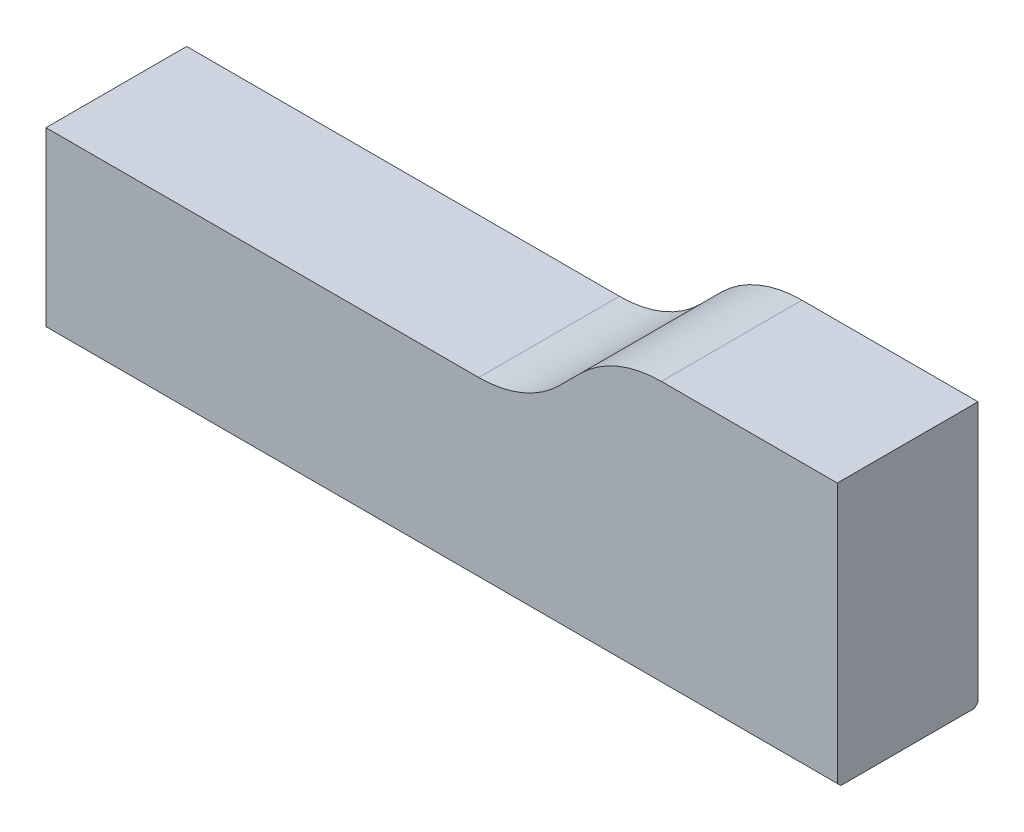
ISO-10303-21;
HEADER;
FILE_DESCRIPTION(('STEP AP214'),'2;1');
FILE_NAME('part.step','',(''),(''),'','','');
FILE_SCHEMA(('AUTOMOTIVE_DESIGN { 1 0 10303 214 1 1 1 1 }'));
ENDSEC;
DATA;
#1=APPLICATION_CONTEXT('core data for automotive mechanical design processes');
#2=APPLICATION_PROTOCOL_DEFINITION('international standard','automotive_design',2000,#1);
#3=PRODUCT_CONTEXT('',#1,'mechanical');
#4=PRODUCT('Part','Part','',(#3));
#5=PRODUCT_RELATED_PRODUCT_CATEGORY('part','',(#4));
#6=PRODUCT_DEFINITION_FORMATION('','',#4);
#7=PRODUCT_DEFINITION_CONTEXT('part definition',#1,'design');
#8=PRODUCT_DEFINITION('design','',#6,#7);
#9=PRODUCT_DEFINITION_SHAPE('','',#8);
#10=(LENGTH_UNIT() NAMED_UNIT(*) SI_UNIT(.MILLI.,.METRE.));
#11=(NAMED_UNIT(*) PLANE_ANGLE_UNIT() SI_UNIT($,.RADIAN.));
#12=(NAMED_UNIT(*) SI_UNIT($,.STERADIAN.) SOLID_ANGLE_UNIT());
#13=UNCERTAINTY_MEASURE_WITH_UNIT(LENGTH_MEASURE(1.E-05),#10,'distance_accuracy_value','');
#14=(GEOMETRIC_REPRESENTATION_CONTEXT(3) GLOBAL_UNCERTAINTY_ASSIGNED_CONTEXT((#13)) GLOBAL_UNIT_ASSIGNED_CONTEXT((#10,
#11,#12)) REPRESENTATION_CONTEXT('',''));
#15=CARTESIAN_POINT('',(0.,0.,0.));
#16=DIRECTION('',(0.,0.,1.));
#17=DIRECTION('',(1.,0.,0.));
#18=AXIS2_PLACEMENT_3D('',#15,#16,#17);
#19=CARTESIAN_POINT('',(-28.8609756097561,4.36585365853658,8.));
#20=DIRECTION('',(1.,0.,0.));
#21=DIRECTION('',(0.,0.,-1.));
#22=AXIS2_PLACEMENT_3D('',#19,#20,#21);
#23=PLANE('',#22);
#24=DIRECTION('',(0.,0.,-1.));
#25=VECTOR('',#24,1.);
#26=CARTESIAN_POINT('',(-28.8609756097561,-5.63414634146342,8.));
#27=LINE('',#26,#25);
#28=CARTESIAN_POINT('',(-28.8609756097561,-5.63414634146342,7.79999999999999));
#29=VERTEX_POINT('',#28);
#30=CARTESIAN_POINT('',(-28.8609756097561,-5.63414634146342,0.199999999999999));
#31=VERTEX_POINT('',#30);
#32=EDGE_CURVE('E172',#29,#31,#27,.T.);
#33=ORIENTED_EDGE('',*,*,#32,.F.);
#34=DIRECTION('',(0.,0.70710678118655,0.707106781186545));
#35=VECTOR('',#34,1.);
#36=CARTESIAN_POINT('',(-28.8609756097561,-5.43414634146341,8.));
#37=LINE('',#36,#35);
#38=CARTESIAN_POINT('',(-28.8609756097561,-5.43414634146341,8.));
#39=VERTEX_POINT('',#38);
#40=EDGE_CURVE('E43',#29,#39,#37,.T.);
#41=ORIENTED_EDGE('',*,*,#40,.T.);
#42=DIRECTION('',(0.,-1.,0.));
#43=VECTOR('',#42,1.);
#44=CARTESIAN_POINT('',(-28.8609756097561,4.36585365853658,8.));
#45=LINE('',#44,#43);
#46=CARTESIAN_POINT('',(-28.8609756097561,4.36585365853658,8.));
#47=VERTEX_POINT('',#46);
#48=EDGE_CURVE('E139',#47,#39,#45,.T.);
#49=ORIENTED_EDGE('',*,*,#48,.F.);
#50=DIRECTION('',(0.,0.,-1.));
#51=VECTOR('',#50,1.);
#52=CARTESIAN_POINT('',(-28.8609756097561,4.36585365853658,8.));
#53=LINE('',#52,#51);
#54=CARTESIAN_POINT('',(-28.8609756097561,4.36585365853658,0.));
#55=VERTEX_POINT('',#54);
#56=EDGE_CURVE('E153',#47,#55,#53,.T.);
#57=ORIENTED_EDGE('',*,*,#56,.T.);
#58=DIRECTION('',(0.,-1.,0.));
#59=VECTOR('',#58,1.);
#60=CARTESIAN_POINT('',(-28.8609756097561,4.36585365853658,0.));
#61=LINE('',#60,#59);
#62=CARTESIAN_POINT('',(-28.8609756097561,-5.43414634146342,0.));
#63=VERTEX_POINT('',#62);
#64=EDGE_CURVE('E138',#55,#63,#61,.T.);
#65=ORIENTED_EDGE('',*,*,#64,.T.);
#66=DIRECTION('',(0.,0.70710678118655,-0.707106781186545));
#67=VECTOR('',#66,1.);
#68=CARTESIAN_POINT('',(-28.8609756097561,-5.63414634146342,0.199999999999999));
#69=LINE('',#68,#67);
#70=EDGE_CURVE('E55',#63,#31,#69,.F.);
#71=ORIENTED_EDGE('',*,*,#70,.T.);
#72=EDGE_LOOP('',(#33,#41,#49,#57,#65,#71));
#73=FACE_BOUND('',#72,.T.);
#74=ADVANCED_FACE('F35',(#73),#23,.F.);
#75=CARTESIAN_POINT('',(-28.8609756097561,-5.63414634146342,8.));
#76=DIRECTION('',(0.,1.,0.));
#77=DIRECTION('',(-1.,0.,0.));
#78=AXIS2_PLACEMENT_3D('',#75,#76,#77);
#79=PLANE('',#78);
#80=CARTESIAN_POINT('',(-21.3609756097561,-5.63414634146342,4.));
#81=DIRECTION('',(0.,-1.,0.));
#82=DIRECTION('',(0.,0.,-1.));
#83=AXIS2_PLACEMENT_3D('',#80,#81,#82);
#84=CIRCLE('',#83,1.24999999999999);
#85=CARTESIAN_POINT('',(-21.3609756097561,-5.63414634146342,2.75000000000001));
#86=VERTEX_POINT('',#85);
#87=EDGE_CURVE('E128',#86,#86,#84,.T.);
#88=ORIENTED_EDGE('',*,*,#87,.F.);
#89=EDGE_LOOP('',(#88));
#90=FACE_BOUND('',#89,.T.);
#91=CARTESIAN_POINT('',(8.6390243902439,-5.63414634146342,4.));
#92=DIRECTION('',(0.,-1.,0.));
#93=DIRECTION('',(0.,0.,-1.));
#94=AXIS2_PLACEMENT_3D('',#91,#92,#93);
#95=CIRCLE('',#94,1.24999999999999);
#96=CARTESIAN_POINT('',(8.6390243902439,-5.63414634146342,2.75000000000001));
#97=VERTEX_POINT('',#96);
#98=EDGE_CURVE('E127',#97,#97,#95,.T.);
#99=ORIENTED_EDGE('',*,*,#98,.F.);
#100=EDGE_LOOP('',(#99));
#101=FACE_BOUND('',#100,.T.);
#102=DIRECTION('',(0.,0.,-1.));
#103=VECTOR('',#102,1.);
#104=CARTESIAN_POINT('',(16.1390243902439,-5.63414634146342,8.));
#105=LINE('',#104,#103);
#106=CARTESIAN_POINT('',(16.1390243902439,-5.63414634146342,7.79999999999999));
#107=VERTEX_POINT('',#106);
#108=CARTESIAN_POINT('',(16.1390243902439,-5.63414634146342,0.199999999999999));
#109=VERTEX_POINT('',#108);
#110=EDGE_CURVE('E169',#107,#109,#105,.T.);
#111=ORIENTED_EDGE('',*,*,#110,.F.);
#112=DIRECTION('',(-1.,0.,0.));
#113=VECTOR('',#112,1.);
#114=CARTESIAN_POINT('',(-28.8609756097561,-5.63414634146342,7.79999999999999));
#115=LINE('',#114,#113);
#116=EDGE_CURVE('E202',#107,#29,#115,.T.);
#117=ORIENTED_EDGE('',*,*,#116,.T.);
#118=ORIENTED_EDGE('',*,*,#32,.T.);
#119=DIRECTION('',(1.,0.,0.));
#120=VECTOR('',#119,1.);
#121=CARTESIAN_POINT('',(-28.8609756097561,-5.63414634146342,0.199999999999999));
#122=LINE('',#121,#120);
#123=EDGE_CURVE('E199',#31,#109,#122,.T.);
#124=ORIENTED_EDGE('',*,*,#123,.T.);
#125=EDGE_LOOP('',(#111,#117,#118,#124));
#126=FACE_BOUND('',#125,.T.);
#127=ADVANCED_FACE('F220',(#90,#101,#126),#79,.F.);
#128=CARTESIAN_POINT('',(16.1390243902439,9.36585365853658,8.));
#129=DIRECTION('',(-1.,0.,0.));
#130=DIRECTION('',(0.,-1.,0.));
#131=AXIS2_PLACEMENT_3D('',#128,#129,#130);
#132=PLANE('',#131);
#133=DIRECTION('',(0.,1.,0.));
#134=VECTOR('',#133,1.);
#135=CARTESIAN_POINT('',(16.1390243902439,9.36585365853658,8.));
#136=LINE('',#135,#134);
#137=CARTESIAN_POINT('',(16.1390243902439,-5.43414634146341,8.));
#138=VERTEX_POINT('',#137);
#139=CARTESIAN_POINT('',(16.1390243902439,9.36585365853658,8.));
#140=VERTEX_POINT('',#139);
#141=EDGE_CURVE('E142',#138,#140,#136,.T.);
#142=ORIENTED_EDGE('',*,*,#141,.F.);
#143=DIRECTION('',(0.,-0.70710678118655,-0.707106781186545));
#144=VECTOR('',#143,1.);
#145=CARTESIAN_POINT('',(16.1390243902439,-5.43414634146341,8.));
#146=LINE('',#145,#144);
#147=EDGE_CURVE('E197',#138,#107,#146,.T.);
#148=ORIENTED_EDGE('',*,*,#147,.T.);
#149=ORIENTED_EDGE('',*,*,#110,.T.);
#150=DIRECTION('',(0.,-0.70710678118655,0.707106781186545));
#151=VECTOR('',#150,1.);
#152=CARTESIAN_POINT('',(16.1390243902439,-5.63414634146341,0.199999999999989));
#153=LINE('',#152,#151);
#154=CARTESIAN_POINT('',(16.1390243902439,-5.43414634146341,0.));
#155=VERTEX_POINT('',#154);
#156=EDGE_CURVE('E195',#109,#155,#153,.F.);
#157=ORIENTED_EDGE('',*,*,#156,.T.);
#158=DIRECTION('',(0.,1.,0.));
#159=VECTOR('',#158,1.);
#160=CARTESIAN_POINT('',(16.1390243902439,9.36585365853658,0.));
#161=LINE('',#160,#159);
#162=CARTESIAN_POINT('',(16.1390243902439,9.36585365853658,0.));
#163=VERTEX_POINT('',#162);
#164=EDGE_CURVE('E155',#155,#163,#161,.T.);
#165=ORIENTED_EDGE('',*,*,#164,.T.);
#166=DIRECTION('',(0.,0.,-1.));
#167=VECTOR('',#166,1.);
#168=CARTESIAN_POINT('',(16.1390243902439,9.36585365853658,8.));
#169=LINE('',#168,#167);
#170=EDGE_CURVE('E166',#140,#163,#169,.T.);
#171=ORIENTED_EDGE('',*,*,#170,.F.);
#172=EDGE_LOOP('',(#142,#148,#149,#157,#165,#171));
#173=FACE_BOUND('',#172,.T.);
#174=ADVANCED_FACE('F217',(#173),#132,.F.);
#175=CARTESIAN_POINT('',(16.1390243902439,9.36585365853658,8.));
#176=DIRECTION('',(0.,-1.,0.));
#177=DIRECTION('',(1.,0.,0.));
#178=AXIS2_PLACEMENT_3D('',#175,#176,#177);
#179=PLANE('',#178);
#180=DIRECTION('',(-1.,0.,0.));
#181=VECTOR('',#180,1.);
#182=CARTESIAN_POINT('',(16.1390243902439,9.36585365853658,0.));
#183=LINE('',#182,#181);
#184=CARTESIAN_POINT('',(6.13141254566901,9.36585365853658,0.));
#185=VERTEX_POINT('',#184);
#186=EDGE_CURVE('E157',#163,#185,#183,.T.);
#187=ORIENTED_EDGE('',*,*,#186,.T.);
#188=DIRECTION('',(0.,0.,-1.));
#189=VECTOR('',#188,1.);
#190=CARTESIAN_POINT('',(6.13141254566901,9.36585365853658,8.));
#191=LINE('',#190,#189);
#192=CARTESIAN_POINT('',(6.13141254566901,9.36585365853658,8.));
#193=VERTEX_POINT('',#192);
#194=EDGE_CURVE('E181',#185,#193,#191,.F.);
#195=ORIENTED_EDGE('',*,*,#194,.T.);
#196=DIRECTION('',(-1.,0.,0.));
#197=VECTOR('',#196,1.);
#198=CARTESIAN_POINT('',(16.1390243902439,9.36585365853658,8.));
#199=LINE('',#198,#197);
#200=EDGE_CURVE('E145',#140,#193,#199,.T.);
#201=ORIENTED_EDGE('',*,*,#200,.F.);
#202=ORIENTED_EDGE('',*,*,#170,.T.);
#203=EDGE_LOOP('',(#187,#195,#201,#202));
#204=FACE_BOUND('',#203,.T.);
#205=ADVANCED_FACE('F228',(#204),#179,.F.);
#206=CARTESIAN_POINT('',(-1.5609756097561,4.36585365853658,8.));
#207=DIRECTION('',(0.707106781186549,-0.707106781186546,0.));
#208=DIRECTION('',(0.707106781186546,0.707106781186549,0.));
#209=AXIS2_PLACEMENT_3D('',#206,#207,#208);
#210=PLANE('',#209);
#211=DIRECTION('',(-0.707106781186546,-0.707106781186549,0.));
#212=VECTOR('',#211,1.);
#213=CARTESIAN_POINT('',(-1.5609756097561,4.36585365853658,8.));
#214=LINE('',#213,#212);
#215=CARTESIAN_POINT('',(1.53521846795644,7.46204773624913,8.));
#216=VERTEX_POINT('',#215);
#217=CARTESIAN_POINT('',(0.342830312531343,6.26965958082403,8.));
#218=VERTEX_POINT('',#217);
#219=EDGE_CURVE('E148',#216,#218,#214,.T.);
#220=ORIENTED_EDGE('',*,*,#219,.F.);
#221=DIRECTION('',(0.,0.,-1.));
#222=VECTOR('',#221,1.);
#223=CARTESIAN_POINT('',(1.53521846795644,7.46204773624913,8.));
#224=LINE('',#223,#222);
#225=CARTESIAN_POINT('',(1.53521846795644,7.46204773624913,0.));
#226=VERTEX_POINT('',#225);
#227=EDGE_CURVE('E176',#216,#226,#224,.T.);
#228=ORIENTED_EDGE('',*,*,#227,.T.);
#229=DIRECTION('',(-0.707106781186546,-0.707106781186549,0.));
#230=VECTOR('',#229,1.);
#231=CARTESIAN_POINT('',(-1.5609756097561,4.36585365853658,0.));
#232=LINE('',#231,#230);
#233=CARTESIAN_POINT('',(0.342830312531343,6.26965958082403,0.));
#234=VERTEX_POINT('',#233);
#235=EDGE_CURVE('E160',#226,#234,#232,.T.);
#236=ORIENTED_EDGE('',*,*,#235,.T.);
#237=DIRECTION('',(0.,0.,-1.));
#238=VECTOR('',#237,1.);
#239=CARTESIAN_POINT('',(0.342830312531343,6.26965958082403,8.));
#240=LINE('',#239,#238);
#241=EDGE_CURVE('E174',#234,#218,#240,.F.);
#242=ORIENTED_EDGE('',*,*,#241,.T.);
#243=EDGE_LOOP('',(#220,#228,#236,#242));
#244=FACE_BOUND('',#243,.T.);
#245=ADVANCED_FACE('F237',(#244),#210,.F.);
#246=CARTESIAN_POINT('',(-28.8609756097561,4.36585365853658,8.));
#247=DIRECTION('',(0.,-1.,0.));
#248=DIRECTION('',(1.,0.,0.));
#249=AXIS2_PLACEMENT_3D('',#246,#247,#248);
#250=PLANE('',#249);
#251=DIRECTION('',(-1.,0.,0.));
#252=VECTOR('',#251,1.);
#253=CARTESIAN_POINT('',(-28.8609756097561,4.36585365853658,8.));
#254=LINE('',#253,#252);
#255=CARTESIAN_POINT('',(-4.25336376518123,4.36585365853658,8.));
#256=VERTEX_POINT('',#255);
#257=EDGE_CURVE('E151',#256,#47,#254,.T.);
#258=ORIENTED_EDGE('',*,*,#257,.F.);
#259=DIRECTION('',(0.,0.,-1.));
#260=VECTOR('',#259,1.);
#261=CARTESIAN_POINT('',(-4.25336376518123,4.36585365853658,0.));
#262=LINE('',#261,#260);
#263=CARTESIAN_POINT('',(-4.25336376518123,4.36585365853658,0.));
#264=VERTEX_POINT('',#263);
#265=EDGE_CURVE('E185',#256,#264,#262,.T.);
#266=ORIENTED_EDGE('',*,*,#265,.T.);
#267=DIRECTION('',(-1.,0.,0.));
#268=VECTOR('',#267,1.);
#269=CARTESIAN_POINT('',(-28.8609756097561,4.36585365853658,0.));
#270=LINE('',#269,#268);
#271=EDGE_CURVE('E143',#264,#55,#270,.T.);
#272=ORIENTED_EDGE('',*,*,#271,.T.);
#273=ORIENTED_EDGE('',*,*,#56,.F.);
#274=EDGE_LOOP('',(#258,#266,#272,#273));
#275=FACE_BOUND('',#274,.T.);
#276=ADVANCED_FACE('F243',(#275),#250,.F.);
#277=CARTESIAN_POINT('',(0.,0.,8.));
#278=DIRECTION('',(0.,0.,1.));
#279=DIRECTION('',(1.,0.,0.));
#280=AXIS2_PLACEMENT_3D('',#277,#278,#279);
#281=PLANE('',#280);
#282=ORIENTED_EDGE('',*,*,#48,.T.);
#283=DIRECTION('',(1.,0.,0.));
#284=VECTOR('',#283,1.);
#285=CARTESIAN_POINT('',(16.1390243902439,-5.43414634146341,8.));
#286=LINE('',#285,#284);
#287=EDGE_CURVE('E192',#39,#138,#286,.T.);
#288=ORIENTED_EDGE('',*,*,#287,.T.);
#289=ORIENTED_EDGE('',*,*,#141,.T.);
#290=ORIENTED_EDGE('',*,*,#200,.T.);
#291=CARTESIAN_POINT('',(6.13141254566901,2.86585365853658,8.));
#292=DIRECTION('',(0.,0.,1.));
#293=DIRECTION('',(1.,0.,0.));
#294=AXIS2_PLACEMENT_3D('',#291,#292,#293);
#295=CIRCLE('',#294,6.5);
#296=EDGE_CURVE('E183',#193,#216,#295,.T.);
#297=ORIENTED_EDGE('',*,*,#296,.T.);
#298=ORIENTED_EDGE('',*,*,#219,.T.);
#299=CARTESIAN_POINT('',(-4.25336376518123,10.8658536585366,8.));
#300=DIRECTION('',(0.,0.,1.));
#301=DIRECTION('',(1.,0.,0.));
#302=AXIS2_PLACEMENT_3D('',#299,#300,#301);
#303=CIRCLE('',#302,6.5);
#304=EDGE_CURVE('E190',#218,#256,#303,.F.);
#305=ORIENTED_EDGE('',*,*,#304,.T.);
#306=ORIENTED_EDGE('',*,*,#257,.T.);
#307=EDGE_LOOP('',(#282,#288,#289,#290,#297,#298,#305,#306));
#308=FACE_BOUND('',#307,.T.);
#309=ADVANCED_FACE('F210',(#308),#281,.T.);
#310=CARTESIAN_POINT('',(0.,0.,0.));
#311=DIRECTION('',(0.,0.,1.));
#312=DIRECTION('',(1.,0.,0.));
#313=AXIS2_PLACEMENT_3D('',#310,#311,#312);
#314=PLANE('',#313);
#315=ORIENTED_EDGE('',*,*,#164,.F.);
#316=DIRECTION('',(-1.,0.,0.));
#317=VECTOR('',#316,1.);
#318=CARTESIAN_POINT('',(0.,-5.43414634146342,0.));
#319=LINE('',#318,#317);
#320=EDGE_CURVE('E11',#155,#63,#319,.T.);
#321=ORIENTED_EDGE('',*,*,#320,.T.);
#322=ORIENTED_EDGE('',*,*,#64,.F.);
#323=ORIENTED_EDGE('',*,*,#271,.F.);
#324=CARTESIAN_POINT('',(-4.25336376518123,10.8658536585366,0.));
#325=DIRECTION('',(0.,0.,1.));
#326=DIRECTION('',(1.,0.,0.));
#327=AXIS2_PLACEMENT_3D('',#324,#325,#326);
#328=CIRCLE('',#327,6.5);
#329=EDGE_CURVE('E188',#264,#234,#328,.T.);
#330=ORIENTED_EDGE('',*,*,#329,.T.);
#331=ORIENTED_EDGE('',*,*,#235,.F.);
#332=CARTESIAN_POINT('',(6.13141254566901,2.86585365853658,0.));
#333=DIRECTION('',(0.,0.,1.));
#334=DIRECTION('',(1.,0.,0.));
#335=AXIS2_PLACEMENT_3D('',#332,#333,#334);
#336=CIRCLE('',#335,6.5);
#337=EDGE_CURVE('E179',#226,#185,#336,.F.);
#338=ORIENTED_EDGE('',*,*,#337,.T.);
#339=ORIENTED_EDGE('',*,*,#186,.F.);
#340=EDGE_LOOP('',(#315,#321,#322,#323,#330,#331,#338,#339));
#341=FACE_BOUND('',#340,.T.);
#342=ADVANCED_FACE('F224',(#341),#314,.F.);
#343=CARTESIAN_POINT('',(6.13141254566901,2.86585365853658,8.));
#344=DIRECTION('',(0.,0.,-1.));
#345=DIRECTION('',(-1.,0.,0.));
#346=AXIS2_PLACEMENT_3D('',#343,#344,#345);
#347=CYLINDRICAL_SURFACE('',#346,6.5);
#348=ORIENTED_EDGE('',*,*,#296,.F.);
#349=ORIENTED_EDGE('',*,*,#194,.F.);
#350=ORIENTED_EDGE('',*,*,#337,.F.);
#351=ORIENTED_EDGE('',*,*,#227,.F.);
#352=EDGE_LOOP('',(#348,#349,#350,#351));
#353=FACE_BOUND('',#352,.T.);
#354=ADVANCED_FACE('F232',(#353),#347,.T.);
#355=CARTESIAN_POINT('',(-4.25336376518123,10.8658536585366,8.));
#356=DIRECTION('',(0.,0.,1.));
#357=DIRECTION('',(1.,0.,0.));
#358=AXIS2_PLACEMENT_3D('',#355,#356,#357);
#359=CYLINDRICAL_SURFACE('',#358,6.5);
#360=ORIENTED_EDGE('',*,*,#304,.F.);
#361=ORIENTED_EDGE('',*,*,#241,.F.);
#362=ORIENTED_EDGE('',*,*,#329,.F.);
#363=ORIENTED_EDGE('',*,*,#265,.F.);
#364=EDGE_LOOP('',(#360,#361,#362,#363));
#365=FACE_BOUND('',#364,.T.);
#366=ADVANCED_FACE('F240',(#365),#359,.F.);
#367=CARTESIAN_POINT('',(0.,-5.43414634146341,8.));
#368=DIRECTION('',(0.,-0.707106781186545,0.707106781186549));
#369=DIRECTION('',(-1.,0.,0.));
#370=AXIS2_PLACEMENT_3D('',#367,#368,#369);
#371=PLANE('',#370);
#372=ORIENTED_EDGE('',*,*,#40,.F.);
#373=ORIENTED_EDGE('',*,*,#116,.F.);
#374=ORIENTED_EDGE('',*,*,#147,.F.);
#375=ORIENTED_EDGE('',*,*,#287,.F.);
#376=EDGE_LOOP('',(#372,#373,#374,#375));
#377=FACE_BOUND('',#376,.T.);
#378=ADVANCED_FACE('F214',(#377),#371,.T.);
#379=CARTESIAN_POINT('',(-28.8609756097561,-5.63414634146342,0.199999999999999));
#380=DIRECTION('',(0.,0.707106781186545,0.70710678118655));
#381=DIRECTION('',(1.,0.,0.));
#382=AXIS2_PLACEMENT_3D('',#379,#380,#381);
#383=PLANE('',#382);
#384=ORIENTED_EDGE('',*,*,#70,.F.);
#385=ORIENTED_EDGE('',*,*,#320,.F.);
#386=ORIENTED_EDGE('',*,*,#156,.F.);
#387=ORIENTED_EDGE('',*,*,#123,.F.);
#388=EDGE_LOOP('',(#384,#385,#386,#387));
#389=FACE_BOUND('',#388,.T.);
#390=ADVANCED_FACE('F37',(#389),#383,.F.);
#391=CARTESIAN_POINT('',(8.6390243902439,0.365853658536584,4.));
#392=DIRECTION('',(0.,-1.,0.));
#393=DIRECTION('',(0.,0.,-1.));
#394=AXIS2_PLACEMENT_3D('',#391,#392,#393);
#395=CONICAL_SURFACE('',#394,1.25,1.02974425867665);
#396=CARTESIAN_POINT('',(8.6390243902439,1.11692943232103,4.));
#397=VERTEX_POINT('',#396);
#398=VERTEX_LOOP('',#397);
#399=FACE_BOUND('',#398,.T.);
#400=CARTESIAN_POINT('',(8.6390243902439,0.365853658536584,4.));
#401=DIRECTION('',(0.,-1.,0.));
#402=DIRECTION('',(0.,0.,-1.));
#403=AXIS2_PLACEMENT_3D('',#400,#401,#402);
#404=CIRCLE('',#403,1.25);
#405=CARTESIAN_POINT('',(8.6390243902439,0.365853658536584,2.75));
#406=VERTEX_POINT('',#405);
#407=EDGE_CURVE('E131',#406,#406,#404,.T.);
#408=ORIENTED_EDGE('',*,*,#407,.T.);
#409=EDGE_LOOP('',(#408));
#410=FACE_BOUND('',#409,.T.);
#411=ADVANCED_FACE('F270',(#399,#410),#395,.F.);
#412=CARTESIAN_POINT('',(8.6390243902439,-5.63414634146342,4.));
#413=DIRECTION('',(0.,-1.,0.));
#414=DIRECTION('',(0.,0.,-1.));
#415=AXIS2_PLACEMENT_3D('',#412,#413,#414);
#416=CYLINDRICAL_SURFACE('',#415,1.24999999999999);
#417=ORIENTED_EDGE('',*,*,#407,.F.);
#418=EDGE_LOOP('',(#417));
#419=FACE_BOUND('',#418,.T.);
#420=ORIENTED_EDGE('',*,*,#98,.T.);
#421=EDGE_LOOP('',(#420));
#422=FACE_BOUND('',#421,.T.);
#423=ADVANCED_FACE('F121',(#419,#422),#416,.F.);
#424=CARTESIAN_POINT('',(-21.3609756097561,0.365853658536584,4.));
#425=DIRECTION('',(0.,-1.,0.));
#426=DIRECTION('',(0.,0.,-1.));
#427=AXIS2_PLACEMENT_3D('',#424,#425,#426);
#428=CONICAL_SURFACE('',#427,1.25,1.02974425867665);
#429=CARTESIAN_POINT('',(-21.3609756097561,1.11692943232103,4.));
#430=VERTEX_POINT('',#429);
#431=VERTEX_LOOP('',#430);
#432=FACE_BOUND('',#431,.T.);
#433=CARTESIAN_POINT('',(-21.3609756097561,0.365853658536584,4.));
#434=DIRECTION('',(0.,-1.,0.));
#435=DIRECTION('',(0.,0.,-1.));
#436=AXIS2_PLACEMENT_3D('',#433,#434,#435);
#437=CIRCLE('',#436,1.25);
#438=CARTESIAN_POINT('',(-21.3609756097561,0.365853658536584,2.75));
#439=VERTEX_POINT('',#438);
#440=EDGE_CURVE('E125',#439,#439,#437,.T.);
#441=ORIENTED_EDGE('',*,*,#440,.T.);
#442=EDGE_LOOP('',(#441));
#443=FACE_BOUND('',#442,.T.);
#444=ADVANCED_FACE('F117',(#432,#443),#428,.F.);
#445=CARTESIAN_POINT('',(-21.3609756097561,-5.63414634146342,4.));
#446=DIRECTION('',(0.,-1.,0.));
#447=DIRECTION('',(0.,0.,-1.));
#448=AXIS2_PLACEMENT_3D('',#445,#446,#447);
#449=CYLINDRICAL_SURFACE('',#448,1.24999999999999);
#450=ORIENTED_EDGE('',*,*,#440,.F.);
#451=EDGE_LOOP('',(#450));
#452=FACE_BOUND('',#451,.T.);
#453=ORIENTED_EDGE('',*,*,#87,.T.);
#454=EDGE_LOOP('',(#453));
#455=FACE_BOUND('',#454,.T.);
#456=ADVANCED_FACE('F120',(#452,#455),#449,.F.);
#457=CLOSED_SHELL('',(#74,#127,#174,#205,#245,#276,#309,#342,#354,#366,#378,#390,#411,#423,#444,#456));
#458=MANIFOLD_SOLID_BREP('B2',#457);
#459=ADVANCED_BREP_SHAPE_REPRESENTATION('',(#18,#458),#14);
#460=SHAPE_DEFINITION_REPRESENTATION(#9,#459);
ENDSEC;
END-ISO-10303-21;
